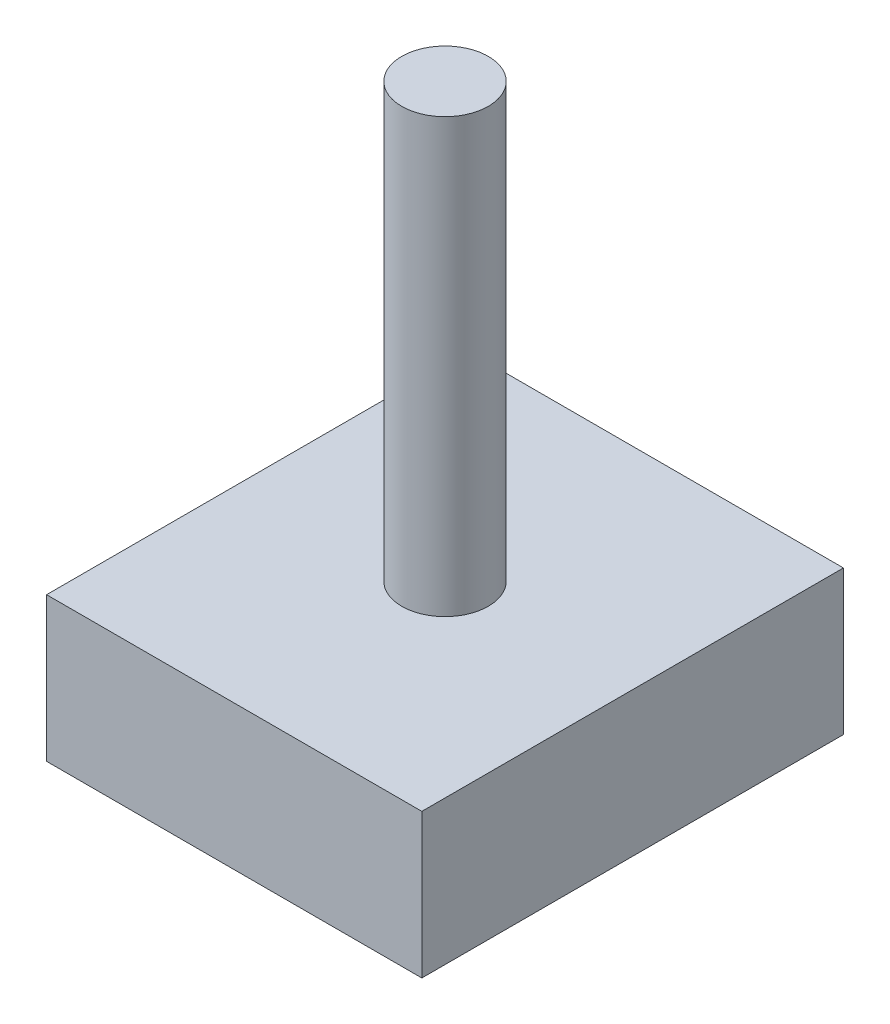
ISO-10303-21;
HEADER;
FILE_DESCRIPTION(('STEP AP214'),'2;1');
FILE_NAME('part.step','',(''),(''),'','','');
FILE_SCHEMA(('AUTOMOTIVE_DESIGN { 1 0 10303 214 1 1 1 1 }'));
ENDSEC;
DATA;
#1=APPLICATION_CONTEXT('core data for automotive mechanical design processes');
#2=APPLICATION_PROTOCOL_DEFINITION('international standard','automotive_design',2000,#1);
#3=PRODUCT_CONTEXT('',#1,'mechanical');
#4=PRODUCT('Part','Part','',(#3));
#5=PRODUCT_RELATED_PRODUCT_CATEGORY('part','',(#4));
#6=PRODUCT_DEFINITION_FORMATION('','',#4);
#7=PRODUCT_DEFINITION_CONTEXT('part definition',#1,'design');
#8=PRODUCT_DEFINITION('design','',#6,#7);
#9=PRODUCT_DEFINITION_SHAPE('','',#8);
#10=(LENGTH_UNIT() NAMED_UNIT(*) SI_UNIT(.MILLI.,.METRE.));
#11=(NAMED_UNIT(*) PLANE_ANGLE_UNIT() SI_UNIT($,.RADIAN.));
#12=(NAMED_UNIT(*) SI_UNIT($,.STERADIAN.) SOLID_ANGLE_UNIT());
#13=UNCERTAINTY_MEASURE_WITH_UNIT(LENGTH_MEASURE(1.E-05),#10,'distance_accuracy_value','');
#14=(GEOMETRIC_REPRESENTATION_CONTEXT(3) GLOBAL_UNCERTAINTY_ASSIGNED_CONTEXT((#13)) GLOBAL_UNIT_ASSIGNED_CONTEXT((#10,
#11,#12)) REPRESENTATION_CONTEXT('',''));
#15=CARTESIAN_POINT('',(0.,0.,0.));
#16=DIRECTION('',(0.,0.,1.));
#17=DIRECTION('',(1.,0.,0.));
#18=AXIS2_PLACEMENT_3D('',#15,#16,#17);
#19=CARTESIAN_POINT('',(6.5,5.,-7.30252685684495));
#20=DIRECTION('',(-1.,0.,0.));
#21=DIRECTION('',(0.,0.,1.));
#22=AXIS2_PLACEMENT_3D('',#19,#20,#21);
#23=PLANE('',#22);
#24=DIRECTION('',(0.,0.,-1.));
#25=VECTOR('',#24,1.);
#26=CARTESIAN_POINT('',(6.5,0.,-7.30252685684495));
#27=LINE('',#26,#25);
#28=CARTESIAN_POINT('',(6.5,0.,7.30252685684495));
#29=VERTEX_POINT('',#28);
#30=CARTESIAN_POINT('',(6.5,0.,-7.30252685684495));
#31=VERTEX_POINT('',#30);
#32=EDGE_CURVE('E107',#29,#31,#27,.T.);
#33=ORIENTED_EDGE('',*,*,#32,.T.);
#34=DIRECTION('',(0.,-1.,0.));
#35=VECTOR('',#34,1.);
#36=CARTESIAN_POINT('',(6.5,5.,-7.30252685684495));
#37=LINE('',#36,#35);
#38=CARTESIAN_POINT('',(6.5,5.,-7.30252685684495));
#39=VERTEX_POINT('',#38);
#40=EDGE_CURVE('E44',#39,#31,#37,.T.);
#41=ORIENTED_EDGE('',*,*,#40,.F.);
#42=DIRECTION('',(0.,0.,-1.));
#43=VECTOR('',#42,1.);
#44=CARTESIAN_POINT('',(6.5,5.,-7.30252685684495));
#45=LINE('',#44,#43);
#46=CARTESIAN_POINT('',(6.5,5.,7.30252685684495));
#47=VERTEX_POINT('',#46);
#48=EDGE_CURVE('E94',#47,#39,#45,.T.);
#49=ORIENTED_EDGE('',*,*,#48,.F.);
#50=DIRECTION('',(0.,-1.,0.));
#51=VECTOR('',#50,1.);
#52=CARTESIAN_POINT('',(6.5,5.,7.30252685684495));
#53=LINE('',#52,#51);
#54=EDGE_CURVE('E103',#47,#29,#53,.T.);
#55=ORIENTED_EDGE('',*,*,#54,.T.);
#56=EDGE_LOOP('',(#33,#41,#49,#55));
#57=FACE_BOUND('',#56,.T.);
#58=ADVANCED_FACE('F41',(#57),#23,.F.);
#59=CARTESIAN_POINT('',(-6.5,5.,-7.30252685684495));
#60=DIRECTION('',(0.,0.,1.));
#61=DIRECTION('',(1.,0.,0.));
#62=AXIS2_PLACEMENT_3D('',#59,#60,#61);
#63=PLANE('',#62);
#64=DIRECTION('',(-1.,0.,0.));
#65=VECTOR('',#64,1.);
#66=CARTESIAN_POINT('',(-6.5,0.,-7.30252685684495));
#67=LINE('',#66,#65);
#68=CARTESIAN_POINT('',(-6.5,0.,-7.30252685684495));
#69=VERTEX_POINT('',#68);
#70=EDGE_CURVE('E99',#31,#69,#67,.T.);
#71=ORIENTED_EDGE('',*,*,#70,.T.);
#72=DIRECTION('',(0.,-1.,0.));
#73=VECTOR('',#72,1.);
#74=CARTESIAN_POINT('',(-6.5,5.,-7.30252685684495));
#75=LINE('',#74,#73);
#76=CARTESIAN_POINT('',(-6.5,5.,-7.30252685684495));
#77=VERTEX_POINT('',#76);
#78=EDGE_CURVE('E97',#77,#69,#75,.T.);
#79=ORIENTED_EDGE('',*,*,#78,.F.);
#80=DIRECTION('',(-1.,0.,0.));
#81=VECTOR('',#80,1.);
#82=CARTESIAN_POINT('',(-6.5,5.,-7.30252685684495));
#83=LINE('',#82,#81);
#84=EDGE_CURVE('E89',#39,#77,#83,.T.);
#85=ORIENTED_EDGE('',*,*,#84,.F.);
#86=ORIENTED_EDGE('',*,*,#40,.T.);
#87=EDGE_LOOP('',(#71,#79,#85,#86));
#88=FACE_BOUND('',#87,.T.);
#89=ADVANCED_FACE('F98',(#88),#63,.F.);
#90=CARTESIAN_POINT('',(-6.5,5.,-7.30252685684495));
#91=DIRECTION('',(1.,0.,0.));
#92=DIRECTION('',(0.,0.,-1.));
#93=AXIS2_PLACEMENT_3D('',#90,#91,#92);
#94=PLANE('',#93);
#95=DIRECTION('',(0.,0.,1.));
#96=VECTOR('',#95,1.);
#97=CARTESIAN_POINT('',(-6.5,0.,-7.30252685684495));
#98=LINE('',#97,#96);
#99=CARTESIAN_POINT('',(-6.5,0.,7.30252685684495));
#100=VERTEX_POINT('',#99);
#101=EDGE_CURVE('E75',#69,#100,#98,.T.);
#102=ORIENTED_EDGE('',*,*,#101,.T.);
#103=DIRECTION('',(0.,-1.,0.));
#104=VECTOR('',#103,1.);
#105=CARTESIAN_POINT('',(-6.5,5.,7.30252685684495));
#106=LINE('',#105,#104);
#107=CARTESIAN_POINT('',(-6.5,5.,7.30252685684495));
#108=VERTEX_POINT('',#107);
#109=EDGE_CURVE('E100',#108,#100,#106,.T.);
#110=ORIENTED_EDGE('',*,*,#109,.F.);
#111=DIRECTION('',(0.,0.,1.));
#112=VECTOR('',#111,1.);
#113=CARTESIAN_POINT('',(-6.5,5.,-7.30252685684495));
#114=LINE('',#113,#112);
#115=EDGE_CURVE('E92',#77,#108,#114,.T.);
#116=ORIENTED_EDGE('',*,*,#115,.F.);
#117=ORIENTED_EDGE('',*,*,#78,.T.);
#118=EDGE_LOOP('',(#102,#110,#116,#117));
#119=FACE_BOUND('',#118,.T.);
#120=ADVANCED_FACE('F101',(#119),#94,.F.);
#121=CARTESIAN_POINT('',(-6.5,5.,7.30252685684495));
#122=DIRECTION('',(0.,0.,-1.));
#123=DIRECTION('',(-1.,0.,0.));
#124=AXIS2_PLACEMENT_3D('',#121,#122,#123);
#125=PLANE('',#124);
#126=DIRECTION('',(1.,0.,0.));
#127=VECTOR('',#126,1.);
#128=CARTESIAN_POINT('',(-6.5,0.,7.30252685684495));
#129=LINE('',#128,#127);
#130=EDGE_CURVE('E81',#100,#29,#129,.T.);
#131=ORIENTED_EDGE('',*,*,#130,.T.);
#132=ORIENTED_EDGE('',*,*,#54,.F.);
#133=DIRECTION('',(1.,0.,0.));
#134=VECTOR('',#133,1.);
#135=CARTESIAN_POINT('',(-6.5,5.,7.30252685684495));
#136=LINE('',#135,#134);
#137=EDGE_CURVE('E58',#108,#47,#136,.T.);
#138=ORIENTED_EDGE('',*,*,#137,.F.);
#139=ORIENTED_EDGE('',*,*,#109,.T.);
#140=EDGE_LOOP('',(#131,#132,#138,#139));
#141=FACE_BOUND('',#140,.T.);
#142=ADVANCED_FACE('F115',(#141),#125,.F.);
#143=CARTESIAN_POINT('',(0.,5.,0.));
#144=DIRECTION('',(0.,1.,0.));
#145=DIRECTION('',(0.,0.,1.));
#146=AXIS2_PLACEMENT_3D('',#143,#144,#145);
#147=PLANE('',#146);
#148=CARTESIAN_POINT('',(0.,5.,0.));
#149=DIRECTION('',(0.,1.,0.));
#150=DIRECTION('',(0.,0.,1.));
#151=AXIS2_PLACEMENT_3D('',#148,#149,#150);
#152=CIRCLE('',#151,1.5);
#153=CARTESIAN_POINT('',(0.,5.,1.5));
#154=VERTEX_POINT('',#153);
#155=EDGE_CURVE('E11',#154,#154,#152,.T.);
#156=ORIENTED_EDGE('',*,*,#155,.F.);
#157=EDGE_LOOP('',(#156));
#158=FACE_BOUND('',#157,.T.);
#159=ORIENTED_EDGE('',*,*,#48,.T.);
#160=ORIENTED_EDGE('',*,*,#84,.T.);
#161=ORIENTED_EDGE('',*,*,#115,.T.);
#162=ORIENTED_EDGE('',*,*,#137,.T.);
#163=EDGE_LOOP('',(#159,#160,#161,#162));
#164=FACE_BOUND('',#163,.T.);
#165=ADVANCED_FACE('F90',(#158,#164),#147,.T.);
#166=CARTESIAN_POINT('',(0.,0.,0.));
#167=DIRECTION('',(0.,1.,0.));
#168=DIRECTION('',(0.,0.,1.));
#169=AXIS2_PLACEMENT_3D('',#166,#167,#168);
#170=PLANE('',#169);
#171=ORIENTED_EDGE('',*,*,#32,.F.);
#172=ORIENTED_EDGE('',*,*,#130,.F.);
#173=ORIENTED_EDGE('',*,*,#101,.F.);
#174=ORIENTED_EDGE('',*,*,#70,.F.);
#175=EDGE_LOOP('',(#171,#172,#173,#174));
#176=FACE_BOUND('',#175,.T.);
#177=ADVANCED_FACE('F118',(#176),#170,.F.);
#178=CARTESIAN_POINT('',(0.,20.,0.));
#179=DIRECTION('',(0.,-1.,0.));
#180=DIRECTION('',(0.,0.,-1.));
#181=AXIS2_PLACEMENT_3D('',#178,#179,#180);
#182=CYLINDRICAL_SURFACE('',#181,1.5);
#183=CARTESIAN_POINT('',(0.,20.,0.));
#184=DIRECTION('',(0.,1.,0.));
#185=DIRECTION('',(0.,0.,1.));
#186=AXIS2_PLACEMENT_3D('',#183,#184,#185);
#187=CIRCLE('',#186,1.5);
#188=CARTESIAN_POINT('',(0.,20.,1.5));
#189=VERTEX_POINT('',#188);
#190=EDGE_CURVE('E110',#189,#189,#187,.T.);
#191=ORIENTED_EDGE('',*,*,#190,.F.);
#192=EDGE_LOOP('',(#191));
#193=FACE_BOUND('',#192,.T.);
#194=ORIENTED_EDGE('',*,*,#155,.T.);
#195=EDGE_LOOP('',(#194));
#196=FACE_BOUND('',#195,.T.);
#197=ADVANCED_FACE('F126',(#193,#196),#182,.T.);
#198=CARTESIAN_POINT('',(0.,20.,0.));
#199=DIRECTION('',(0.,1.,0.));
#200=DIRECTION('',(0.,0.,1.));
#201=AXIS2_PLACEMENT_3D('',#198,#199,#200);
#202=PLANE('',#201);
#203=ORIENTED_EDGE('',*,*,#190,.T.);
#204=EDGE_LOOP('',(#203));
#205=FACE_BOUND('',#204,.T.);
#206=ADVANCED_FACE('F124',(#205),#202,.T.);
#207=CLOSED_SHELL('',(#58,#89,#120,#142,#165,#177,#197,#206));
#208=MANIFOLD_SOLID_BREP('B2',#207);
#209=ADVANCED_BREP_SHAPE_REPRESENTATION('',(#18,#208),#14);
#210=SHAPE_DEFINITION_REPRESENTATION(#9,#209);
ENDSEC;
END-ISO-10303-21;
